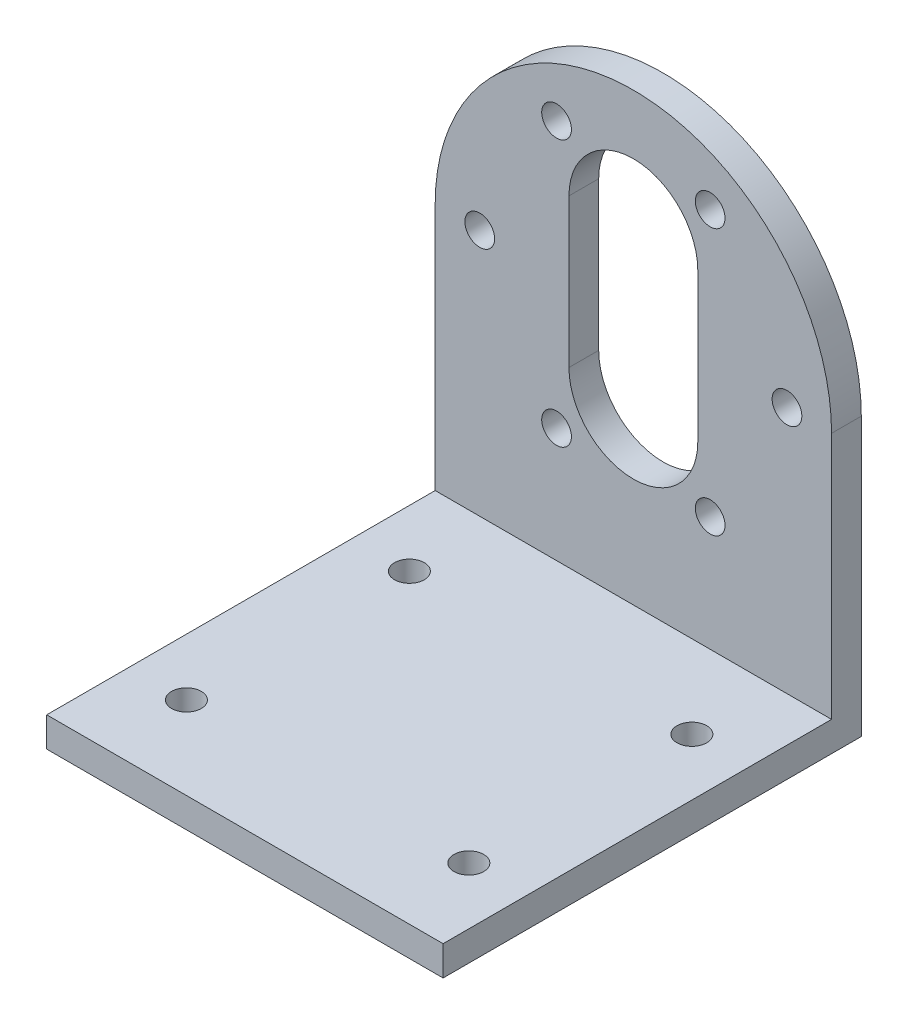
ISO-10303-21;
HEADER;
FILE_DESCRIPTION(('STEP AP214'),'2;1');
FILE_NAME('part.step','',(''),(''),'','','');
FILE_SCHEMA(('AUTOMOTIVE_DESIGN { 1 0 10303 214 1 1 1 1 }'));
ENDSEC;
DATA;
#1=APPLICATION_CONTEXT('core data for automotive mechanical design processes');
#2=APPLICATION_PROTOCOL_DEFINITION('international standard','automotive_design',2000,#1);
#3=PRODUCT_CONTEXT('',#1,'mechanical');
#4=PRODUCT('Part','Part','',(#3));
#5=PRODUCT_RELATED_PRODUCT_CATEGORY('part','',(#4));
#6=PRODUCT_DEFINITION_FORMATION('','',#4);
#7=PRODUCT_DEFINITION_CONTEXT('part definition',#1,'design');
#8=PRODUCT_DEFINITION('design','',#6,#7);
#9=PRODUCT_DEFINITION_SHAPE('','',#8);
#10=(LENGTH_UNIT() NAMED_UNIT(*) SI_UNIT(.MILLI.,.METRE.));
#11=(NAMED_UNIT(*) PLANE_ANGLE_UNIT() SI_UNIT($,.RADIAN.));
#12=(NAMED_UNIT(*) SI_UNIT($,.STERADIAN.) SOLID_ANGLE_UNIT());
#13=UNCERTAINTY_MEASURE_WITH_UNIT(LENGTH_MEASURE(1.E-05),#10,'distance_accuracy_value','');
#14=(GEOMETRIC_REPRESENTATION_CONTEXT(3) GLOBAL_UNCERTAINTY_ASSIGNED_CONTEXT((#13)) GLOBAL_UNIT_ASSIGNED_CONTEXT((#10,
#11,#12)) REPRESENTATION_CONTEXT('',''));
#15=CARTESIAN_POINT('',(0.,0.,0.));
#16=DIRECTION('',(0.,0.,1.));
#17=DIRECTION('',(1.,0.,0.));
#18=AXIS2_PLACEMENT_3D('',#15,#16,#17);
#19=CARTESIAN_POINT('',(0.,0.,3.));
#20=DIRECTION('',(0.,0.,1.));
#21=DIRECTION('',(1.,0.,0.));
#22=AXIS2_PLACEMENT_3D('',#19,#20,#21);
#23=PLANE('',#22);
#24=CARTESIAN_POINT('',(7.74999999999988,-13.4233937586589,3.));
#25=DIRECTION('',(0.,0.,1.));
#26=DIRECTION('',(1.,0.,0.));
#27=AXIS2_PLACEMENT_3D('',#24,#25,#26);
#28=CIRCLE('',#27,1.5);
#29=CARTESIAN_POINT('',(9.24999999999988,-13.4233937586589,3.));
#30=VERTEX_POINT('',#29);
#31=EDGE_CURVE('E147',#30,#30,#28,.T.);
#32=ORIENTED_EDGE('',*,*,#31,.F.);
#33=EDGE_LOOP('',(#32));
#34=FACE_BOUND('',#33,.T.);
#35=CARTESIAN_POINT('',(7.75000000000006,13.4233937586588,3.));
#36=DIRECTION('',(0.,0.,1.));
#37=DIRECTION('',(1.,0.,0.));
#38=AXIS2_PLACEMENT_3D('',#35,#36,#37);
#39=CIRCLE('',#38,1.5);
#40=CARTESIAN_POINT('',(9.25000000000006,13.4233937586588,3.));
#41=VERTEX_POINT('',#40);
#42=EDGE_CURVE('E159',#41,#41,#39,.T.);
#43=ORIENTED_EDGE('',*,*,#42,.F.);
#44=EDGE_LOOP('',(#43));
#45=FACE_BOUND('',#44,.T.);
#46=CARTESIAN_POINT('',(-15.5,0.,3.));
#47=DIRECTION('',(0.,0.,1.));
#48=DIRECTION('',(1.,0.,0.));
#49=AXIS2_PLACEMENT_3D('',#46,#47,#48);
#50=CIRCLE('',#49,1.5);
#51=CARTESIAN_POINT('',(-14.,0.,3.));
#52=VERTEX_POINT('',#51);
#53=EDGE_CURVE('E171',#52,#52,#50,.T.);
#54=ORIENTED_EDGE('',*,*,#53,.F.);
#55=EDGE_LOOP('',(#54));
#56=FACE_BOUND('',#55,.T.);
#57=DIRECTION('',(0.,-1.,0.));
#58=VECTOR('',#57,1.);
#59=CARTESIAN_POINT('',(-6.5,7.5,3.));
#60=LINE('',#59,#58);
#61=CARTESIAN_POINT('',(-6.5,7.5,3.));
#62=VERTEX_POINT('',#61);
#63=CARTESIAN_POINT('',(-6.5,-7.5,3.));
#64=VERTEX_POINT('',#63);
#65=EDGE_CURVE('E179',#62,#64,#60,.T.);
#66=ORIENTED_EDGE('',*,*,#65,.F.);
#67=CARTESIAN_POINT('',(0.,7.5,3.));
#68=DIRECTION('',(0.,0.,1.));
#69=DIRECTION('',(1.,0.,0.));
#70=AXIS2_PLACEMENT_3D('',#67,#68,#69);
#71=CIRCLE('',#70,6.5);
#72=CARTESIAN_POINT('',(6.5,7.5,3.));
#73=VERTEX_POINT('',#72);
#74=EDGE_CURVE('E177',#73,#62,#71,.T.);
#75=ORIENTED_EDGE('',*,*,#74,.F.);
#76=DIRECTION('',(0.,1.,0.));
#77=VECTOR('',#76,1.);
#78=CARTESIAN_POINT('',(6.5,7.5,3.));
#79=LINE('',#78,#77);
#80=CARTESIAN_POINT('',(6.5,-7.5,3.));
#81=VERTEX_POINT('',#80);
#82=EDGE_CURVE('E185',#81,#73,#79,.T.);
#83=ORIENTED_EDGE('',*,*,#82,.F.);
#84=CARTESIAN_POINT('',(0.,-7.5,3.));
#85=DIRECTION('',(0.,0.,1.));
#86=DIRECTION('',(1.,0.,0.));
#87=AXIS2_PLACEMENT_3D('',#84,#85,#86);
#88=CIRCLE('',#87,6.5);
#89=EDGE_CURVE('E182',#64,#81,#88,.T.);
#90=ORIENTED_EDGE('',*,*,#89,.F.);
#91=EDGE_LOOP('',(#66,#75,#83,#90));
#92=FACE_BOUND('',#91,.T.);
#93=CARTESIAN_POINT('',(-7.74999999999997,13.4233937586588,3.));
#94=DIRECTION('',(0.,0.,1.));
#95=DIRECTION('',(1.,0.,0.));
#96=AXIS2_PLACEMENT_3D('',#93,#94,#95);
#97=CIRCLE('',#96,1.5);
#98=CARTESIAN_POINT('',(-6.24999999999997,13.4233937586588,3.));
#99=VERTEX_POINT('',#98);
#100=EDGE_CURVE('E165',#99,#99,#97,.T.);
#101=ORIENTED_EDGE('',*,*,#100,.F.);
#102=EDGE_LOOP('',(#101));
#103=FACE_BOUND('',#102,.T.);
#104=CARTESIAN_POINT('',(15.5,-1.06657560583411E-13,3.));
#105=DIRECTION('',(0.,0.,1.));
#106=DIRECTION('',(1.,0.,0.));
#107=AXIS2_PLACEMENT_3D('',#104,#105,#106);
#108=CIRCLE('',#107,1.5);
#109=CARTESIAN_POINT('',(17.,-1.06657560583411E-13,3.));
#110=VERTEX_POINT('',#109);
#111=EDGE_CURVE('E153',#110,#110,#108,.T.);
#112=ORIENTED_EDGE('',*,*,#111,.F.);
#113=EDGE_LOOP('',(#112));
#114=FACE_BOUND('',#113,.T.);
#115=CARTESIAN_POINT('',(-7.75000000000016,-13.4233937586587,3.));
#116=DIRECTION('',(0.,0.,1.));
#117=DIRECTION('',(1.,0.,0.));
#118=AXIS2_PLACEMENT_3D('',#115,#116,#117);
#119=CIRCLE('',#118,1.5);
#120=CARTESIAN_POINT('',(-6.25000000000015,-13.4233937586587,3.));
#121=VERTEX_POINT('',#120);
#122=EDGE_CURVE('E141',#121,#121,#119,.T.);
#123=ORIENTED_EDGE('',*,*,#122,.F.);
#124=EDGE_LOOP('',(#123));
#125=FACE_BOUND('',#124,.T.);
#126=DIRECTION('',(0.,-1.,0.));
#127=VECTOR('',#126,1.);
#128=CARTESIAN_POINT('',(-20.,0.,3.));
#129=LINE('',#128,#127);
#130=CARTESIAN_POINT('',(-20.,0.,3.));
#131=VERTEX_POINT('',#130);
#132=CARTESIAN_POINT('',(-20.,-25.,3.));
#133=VERTEX_POINT('',#132);
#134=EDGE_CURVE('E47',#131,#133,#129,.T.);
#135=ORIENTED_EDGE('',*,*,#134,.T.);
#136=DIRECTION('',(1.,0.,0.));
#137=VECTOR('',#136,1.);
#138=CARTESIAN_POINT('',(0.,-25.,3.));
#139=LINE('',#138,#137);
#140=CARTESIAN_POINT('',(20.,-25.,3.));
#141=VERTEX_POINT('',#140);
#142=EDGE_CURVE('E51',#133,#141,#139,.T.);
#143=ORIENTED_EDGE('',*,*,#142,.T.);
#144=DIRECTION('',(0.,1.,0.));
#145=VECTOR('',#144,1.);
#146=CARTESIAN_POINT('',(20.,-28.,3.));
#147=LINE('',#146,#145);
#148=CARTESIAN_POINT('',(20.,0.,3.));
#149=VERTEX_POINT('',#148);
#150=EDGE_CURVE('E114',#141,#149,#147,.T.);
#151=ORIENTED_EDGE('',*,*,#150,.T.);
#152=CARTESIAN_POINT('',(0.,0.,3.));
#153=DIRECTION('',(0.,0.,1.));
#154=DIRECTION('',(1.,0.,0.));
#155=AXIS2_PLACEMENT_3D('',#152,#153,#154);
#156=CIRCLE('',#155,20.);
#157=EDGE_CURVE('E208',#149,#131,#156,.T.);
#158=ORIENTED_EDGE('',*,*,#157,.T.);
#159=EDGE_LOOP('',(#135,#143,#151,#158));
#160=FACE_BOUND('',#159,.T.);
#161=ADVANCED_FACE('F32',(#34,#45,#56,#92,#103,#114,#125,#160),#23,.T.);
#162=CARTESIAN_POINT('',(0.,0.,0.));
#163=DIRECTION('',(0.,0.,1.));
#164=DIRECTION('',(1.,0.,0.));
#165=AXIS2_PLACEMENT_3D('',#162,#163,#164);
#166=PLANE('',#165);
#167=DIRECTION('',(1.,0.,0.));
#168=VECTOR('',#167,1.);
#169=CARTESIAN_POINT('',(-20.,-28.,0.));
#170=LINE('',#169,#168);
#171=CARTESIAN_POINT('',(-20.,-28.,0.));
#172=VERTEX_POINT('',#171);
#173=CARTESIAN_POINT('',(20.,-28.,0.));
#174=VERTEX_POINT('',#173);
#175=EDGE_CURVE('E218',#172,#174,#170,.T.);
#176=ORIENTED_EDGE('',*,*,#175,.F.);
#177=DIRECTION('',(0.,-1.,0.));
#178=VECTOR('',#177,1.);
#179=CARTESIAN_POINT('',(-20.,0.,0.));
#180=LINE('',#179,#178);
#181=CARTESIAN_POINT('',(-20.,0.,0.));
#182=VERTEX_POINT('',#181);
#183=EDGE_CURVE('E216',#182,#172,#180,.T.);
#184=ORIENTED_EDGE('',*,*,#183,.F.);
#185=CARTESIAN_POINT('',(0.,0.,0.));
#186=DIRECTION('',(0.,0.,1.));
#187=DIRECTION('',(1.,0.,0.));
#188=AXIS2_PLACEMENT_3D('',#185,#186,#187);
#189=CIRCLE('',#188,20.);
#190=CARTESIAN_POINT('',(20.,0.,0.));
#191=VERTEX_POINT('',#190);
#192=EDGE_CURVE('E207',#191,#182,#189,.T.);
#193=ORIENTED_EDGE('',*,*,#192,.F.);
#194=DIRECTION('',(0.,1.,0.));
#195=VECTOR('',#194,1.);
#196=CARTESIAN_POINT('',(20.,-28.,0.));
#197=LINE('',#196,#195);
#198=EDGE_CURVE('E210',#174,#191,#197,.T.);
#199=ORIENTED_EDGE('',*,*,#198,.F.);
#200=EDGE_LOOP('',(#176,#184,#193,#199));
#201=FACE_BOUND('',#200,.T.);
#202=CARTESIAN_POINT('',(-7.75000000000016,-13.4233937586587,0.));
#203=DIRECTION('',(0.,0.,1.));
#204=DIRECTION('',(1.,0.,0.));
#205=AXIS2_PLACEMENT_3D('',#202,#203,#204);
#206=CIRCLE('',#205,1.5);
#207=CARTESIAN_POINT('',(-6.25000000000015,-13.4233937586587,0.));
#208=VERTEX_POINT('',#207);
#209=EDGE_CURVE('E140',#208,#208,#206,.T.);
#210=ORIENTED_EDGE('',*,*,#209,.T.);
#211=EDGE_LOOP('',(#210));
#212=FACE_BOUND('',#211,.T.);
#213=CARTESIAN_POINT('',(7.74999999999988,-13.4233937586589,0.));
#214=DIRECTION('',(0.,0.,1.));
#215=DIRECTION('',(1.,0.,0.));
#216=AXIS2_PLACEMENT_3D('',#213,#214,#215);
#217=CIRCLE('',#216,1.5);
#218=CARTESIAN_POINT('',(9.24999999999988,-13.4233937586589,0.));
#219=VERTEX_POINT('',#218);
#220=EDGE_CURVE('E144',#219,#219,#217,.T.);
#221=ORIENTED_EDGE('',*,*,#220,.T.);
#222=EDGE_LOOP('',(#221));
#223=FACE_BOUND('',#222,.T.);
#224=CARTESIAN_POINT('',(15.5,-1.06657560583411E-13,0.));
#225=DIRECTION('',(0.,0.,1.));
#226=DIRECTION('',(1.,0.,0.));
#227=AXIS2_PLACEMENT_3D('',#224,#225,#226);
#228=CIRCLE('',#227,1.5);
#229=CARTESIAN_POINT('',(17.,-1.06657560583411E-13,0.));
#230=VERTEX_POINT('',#229);
#231=EDGE_CURVE('E150',#230,#230,#228,.T.);
#232=ORIENTED_EDGE('',*,*,#231,.T.);
#233=EDGE_LOOP('',(#232));
#234=FACE_BOUND('',#233,.T.);
#235=CARTESIAN_POINT('',(7.75000000000006,13.4233937586588,0.));
#236=DIRECTION('',(0.,0.,1.));
#237=DIRECTION('',(1.,0.,0.));
#238=AXIS2_PLACEMENT_3D('',#235,#236,#237);
#239=CIRCLE('',#238,1.5);
#240=CARTESIAN_POINT('',(9.25000000000006,13.4233937586588,0.));
#241=VERTEX_POINT('',#240);
#242=EDGE_CURVE('E156',#241,#241,#239,.T.);
#243=ORIENTED_EDGE('',*,*,#242,.T.);
#244=EDGE_LOOP('',(#243));
#245=FACE_BOUND('',#244,.T.);
#246=CARTESIAN_POINT('',(-7.74999999999997,13.4233937586588,0.));
#247=DIRECTION('',(0.,0.,1.));
#248=DIRECTION('',(1.,0.,0.));
#249=AXIS2_PLACEMENT_3D('',#246,#247,#248);
#250=CIRCLE('',#249,1.5);
#251=CARTESIAN_POINT('',(-6.24999999999997,13.4233937586588,0.));
#252=VERTEX_POINT('',#251);
#253=EDGE_CURVE('E162',#252,#252,#250,.T.);
#254=ORIENTED_EDGE('',*,*,#253,.T.);
#255=EDGE_LOOP('',(#254));
#256=FACE_BOUND('',#255,.T.);
#257=CARTESIAN_POINT('',(-15.5,0.,0.));
#258=DIRECTION('',(0.,0.,1.));
#259=DIRECTION('',(1.,0.,0.));
#260=AXIS2_PLACEMENT_3D('',#257,#258,#259);
#261=CIRCLE('',#260,1.5);
#262=CARTESIAN_POINT('',(-14.,0.,0.));
#263=VERTEX_POINT('',#262);
#264=EDGE_CURVE('E168',#263,#263,#261,.T.);
#265=ORIENTED_EDGE('',*,*,#264,.T.);
#266=EDGE_LOOP('',(#265));
#267=FACE_BOUND('',#266,.T.);
#268=CARTESIAN_POINT('',(0.,7.5,0.));
#269=DIRECTION('',(0.,0.,1.));
#270=DIRECTION('',(1.,0.,0.));
#271=AXIS2_PLACEMENT_3D('',#268,#269,#270);
#272=CIRCLE('',#271,6.5);
#273=CARTESIAN_POINT('',(6.5,7.5,0.));
#274=VERTEX_POINT('',#273);
#275=CARTESIAN_POINT('',(-6.5,7.5,0.));
#276=VERTEX_POINT('',#275);
#277=EDGE_CURVE('E174',#274,#276,#272,.T.);
#278=ORIENTED_EDGE('',*,*,#277,.T.);
#279=DIRECTION('',(0.,-1.,0.));
#280=VECTOR('',#279,1.);
#281=CARTESIAN_POINT('',(-6.5,7.5,0.));
#282=LINE('',#281,#280);
#283=CARTESIAN_POINT('',(-6.5,-7.5,0.));
#284=VERTEX_POINT('',#283);
#285=EDGE_CURVE('E190',#276,#284,#282,.T.);
#286=ORIENTED_EDGE('',*,*,#285,.T.);
#287=CARTESIAN_POINT('',(0.,-7.5,0.));
#288=DIRECTION('',(0.,0.,1.));
#289=DIRECTION('',(1.,0.,0.));
#290=AXIS2_PLACEMENT_3D('',#287,#288,#289);
#291=CIRCLE('',#290,6.5);
#292=CARTESIAN_POINT('',(6.5,-7.5,0.));
#293=VERTEX_POINT('',#292);
#294=EDGE_CURVE('E193',#284,#293,#291,.T.);
#295=ORIENTED_EDGE('',*,*,#294,.T.);
#296=DIRECTION('',(0.,1.,0.));
#297=VECTOR('',#296,1.);
#298=CARTESIAN_POINT('',(6.5,7.5,0.));
#299=LINE('',#298,#297);
#300=EDGE_CURVE('E180',#293,#274,#299,.T.);
#301=ORIENTED_EDGE('',*,*,#300,.T.);
#302=EDGE_LOOP('',(#278,#286,#295,#301));
#303=FACE_BOUND('',#302,.T.);
#304=ADVANCED_FACE('F232',(#201,#212,#223,#234,#245,#256,#267,#303),#166,.F.);
#305=CARTESIAN_POINT('',(0.,0.,3.));
#306=DIRECTION('',(0.,0.,-1.));
#307=DIRECTION('',(-1.,0.,0.));
#308=AXIS2_PLACEMENT_3D('',#305,#306,#307);
#309=CYLINDRICAL_SURFACE('',#308,20.);
#310=ORIENTED_EDGE('',*,*,#192,.T.);
#311=DIRECTION('',(0.,0.,-1.));
#312=VECTOR('',#311,1.);
#313=CARTESIAN_POINT('',(-20.,0.,3.));
#314=LINE('',#313,#312);
#315=EDGE_CURVE('E11',#131,#182,#314,.T.);
#316=ORIENTED_EDGE('',*,*,#315,.F.);
#317=ORIENTED_EDGE('',*,*,#157,.F.);
#318=DIRECTION('',(0.,0.,-1.));
#319=VECTOR('',#318,1.);
#320=CARTESIAN_POINT('',(20.,0.,3.));
#321=LINE('',#320,#319);
#322=EDGE_CURVE('E213',#149,#191,#321,.T.);
#323=ORIENTED_EDGE('',*,*,#322,.T.);
#324=EDGE_LOOP('',(#310,#316,#317,#323));
#325=FACE_BOUND('',#324,.T.);
#326=ADVANCED_FACE('F34',(#325),#309,.T.);
#327=CARTESIAN_POINT('',(-20.,0.,3.));
#328=DIRECTION('',(1.,0.,0.));
#329=DIRECTION('',(0.,1.,0.));
#330=AXIS2_PLACEMENT_3D('',#327,#328,#329);
#331=PLANE('',#330);
#332=DIRECTION('',(0.,0.,-1.));
#333=VECTOR('',#332,1.);
#334=CARTESIAN_POINT('',(-20.,-28.,3.));
#335=LINE('',#334,#333);
#336=CARTESIAN_POINT('',(-20.,-28.,42.2));
#337=VERTEX_POINT('',#336);
#338=EDGE_CURVE('E40',#337,#172,#335,.T.);
#339=ORIENTED_EDGE('',*,*,#338,.F.);
#340=DIRECTION('',(0.,-1.,0.));
#341=VECTOR('',#340,1.);
#342=CARTESIAN_POINT('',(-20.,-25.,42.2));
#343=LINE('',#342,#341);
#344=CARTESIAN_POINT('',(-20.,-25.,42.2));
#345=VERTEX_POINT('',#344);
#346=EDGE_CURVE('E125',#345,#337,#343,.T.);
#347=ORIENTED_EDGE('',*,*,#346,.F.);
#348=DIRECTION('',(0.,0.,-1.));
#349=VECTOR('',#348,1.);
#350=CARTESIAN_POINT('',(-20.,-25.,0.));
#351=LINE('',#350,#349);
#352=EDGE_CURVE('E126',#345,#133,#351,.T.);
#353=ORIENTED_EDGE('',*,*,#352,.T.);
#354=ORIENTED_EDGE('',*,*,#134,.F.);
#355=ORIENTED_EDGE('',*,*,#315,.T.);
#356=ORIENTED_EDGE('',*,*,#183,.T.);
#357=EDGE_LOOP('',(#339,#347,#353,#354,#355,#356));
#358=FACE_BOUND('',#357,.T.);
#359=ADVANCED_FACE('F254',(#358),#331,.F.);
#360=CARTESIAN_POINT('',(-20.,-28.,3.));
#361=DIRECTION('',(0.,1.,0.));
#362=DIRECTION('',(-1.,0.,0.));
#363=AXIS2_PLACEMENT_3D('',#360,#361,#362);
#364=PLANE('',#363);
#365=ORIENTED_EDGE('',*,*,#175,.T.);
#366=DIRECTION('',(0.,0.,-1.));
#367=VECTOR('',#366,1.);
#368=CARTESIAN_POINT('',(20.,-28.,3.));
#369=LINE('',#368,#367);
#370=CARTESIAN_POINT('',(20.,-28.,42.2));
#371=VERTEX_POINT('',#370);
#372=EDGE_CURVE('E223',#371,#174,#369,.T.);
#373=ORIENTED_EDGE('',*,*,#372,.F.);
#374=DIRECTION('',(-1.,0.,0.));
#375=VECTOR('',#374,1.);
#376=CARTESIAN_POINT('',(20.,-28.,42.2));
#377=LINE('',#376,#375);
#378=EDGE_CURVE('E118',#371,#337,#377,.T.);
#379=ORIENTED_EDGE('',*,*,#378,.T.);
#380=ORIENTED_EDGE('',*,*,#338,.T.);
#381=EDGE_LOOP('',(#365,#373,#379,#380));
#382=FACE_BOUND('',#381,.T.);
#383=CARTESIAN_POINT('',(-14.2500000000001,-28.,33.85));
#384=DIRECTION('',(0.,-1.,0.));
#385=DIRECTION('',(1.,0.,0.));
#386=AXIS2_PLACEMENT_3D('',#383,#384,#385);
#387=CIRCLE('',#386,1.5);
#388=CARTESIAN_POINT('',(-12.7500000000001,-28.,33.85));
#389=VERTEX_POINT('',#388);
#390=EDGE_CURVE('E496',#389,#389,#387,.T.);
#391=ORIENTED_EDGE('',*,*,#390,.F.);
#392=EDGE_LOOP('',(#391));
#393=FACE_BOUND('',#392,.T.);
#394=CARTESIAN_POINT('',(14.2499999999999,-28.,33.85));
#395=DIRECTION('',(0.,-1.,0.));
#396=DIRECTION('',(1.,0.,0.));
#397=AXIS2_PLACEMENT_3D('',#394,#395,#396);
#398=CIRCLE('',#397,1.5);
#399=CARTESIAN_POINT('',(15.7499999999999,-28.,33.85));
#400=VERTEX_POINT('',#399);
#401=EDGE_CURVE('E498',#400,#400,#398,.T.);
#402=ORIENTED_EDGE('',*,*,#401,.F.);
#403=EDGE_LOOP('',(#402));
#404=FACE_BOUND('',#403,.T.);
#405=CARTESIAN_POINT('',(14.25,-28.,11.35));
#406=DIRECTION('',(0.,-1.,0.));
#407=DIRECTION('',(1.,0.,0.));
#408=AXIS2_PLACEMENT_3D('',#405,#406,#407);
#409=CIRCLE('',#408,1.5);
#410=CARTESIAN_POINT('',(15.75,-28.,11.35));
#411=VERTEX_POINT('',#410);
#412=EDGE_CURVE('E504',#411,#411,#409,.T.);
#413=ORIENTED_EDGE('',*,*,#412,.F.);
#414=EDGE_LOOP('',(#413));
#415=FACE_BOUND('',#414,.T.);
#416=CARTESIAN_POINT('',(-14.25,-28.,11.35));
#417=DIRECTION('',(0.,-1.,0.));
#418=DIRECTION('',(1.,0.,0.));
#419=AXIS2_PLACEMENT_3D('',#416,#417,#418);
#420=CIRCLE('',#419,1.5);
#421=CARTESIAN_POINT('',(-12.75,-28.,11.35));
#422=VERTEX_POINT('',#421);
#423=EDGE_CURVE('E510',#422,#422,#420,.T.);
#424=ORIENTED_EDGE('',*,*,#423,.F.);
#425=EDGE_LOOP('',(#424));
#426=FACE_BOUND('',#425,.T.);
#427=ADVANCED_FACE('F227',(#382,#393,#404,#415,#426),#364,.F.);
#428=CARTESIAN_POINT('',(20.,-28.,3.));
#429=DIRECTION('',(-1.,0.,0.));
#430=DIRECTION('',(0.,-1.,0.));
#431=AXIS2_PLACEMENT_3D('',#428,#429,#430);
#432=PLANE('',#431);
#433=ORIENTED_EDGE('',*,*,#198,.T.);
#434=ORIENTED_EDGE('',*,*,#322,.F.);
#435=ORIENTED_EDGE('',*,*,#150,.F.);
#436=DIRECTION('',(0.,0.,1.));
#437=VECTOR('',#436,1.);
#438=CARTESIAN_POINT('',(20.,-25.,0.));
#439=LINE('',#438,#437);
#440=CARTESIAN_POINT('',(20.,-25.,42.2));
#441=VERTEX_POINT('',#440);
#442=EDGE_CURVE('E107',#141,#441,#439,.T.);
#443=ORIENTED_EDGE('',*,*,#442,.T.);
#444=DIRECTION('',(0.,-1.,0.));
#445=VECTOR('',#444,1.);
#446=CARTESIAN_POINT('',(20.,-25.,42.2));
#447=LINE('',#446,#445);
#448=EDGE_CURVE('E111',#441,#371,#447,.T.);
#449=ORIENTED_EDGE('',*,*,#448,.T.);
#450=ORIENTED_EDGE('',*,*,#372,.T.);
#451=EDGE_LOOP('',(#433,#434,#435,#443,#449,#450));
#452=FACE_BOUND('',#451,.T.);
#453=ADVANCED_FACE('F109',(#452),#432,.F.);
#454=CARTESIAN_POINT('',(0.,7.5,3.));
#455=DIRECTION('',(0.,0.,-1.));
#456=DIRECTION('',(-1.,0.,0.));
#457=AXIS2_PLACEMENT_3D('',#454,#455,#456);
#458=CYLINDRICAL_SURFACE('',#457,6.5);
#459=ORIENTED_EDGE('',*,*,#277,.F.);
#460=DIRECTION('',(0.,0.,-1.));
#461=VECTOR('',#460,1.);
#462=CARTESIAN_POINT('',(6.5,7.5,3.));
#463=LINE('',#462,#461);
#464=EDGE_CURVE('E187',#73,#274,#463,.T.);
#465=ORIENTED_EDGE('',*,*,#464,.F.);
#466=ORIENTED_EDGE('',*,*,#74,.T.);
#467=DIRECTION('',(0.,0.,-1.));
#468=VECTOR('',#467,1.);
#469=CARTESIAN_POINT('',(-6.5,7.5,3.));
#470=LINE('',#469,#468);
#471=EDGE_CURVE('E204',#62,#276,#470,.T.);
#472=ORIENTED_EDGE('',*,*,#471,.T.);
#473=EDGE_LOOP('',(#459,#465,#466,#472));
#474=FACE_BOUND('',#473,.T.);
#475=ADVANCED_FACE('F248',(#474),#458,.F.);
#476=CARTESIAN_POINT('',(-6.5,7.5,3.));
#477=DIRECTION('',(1.,0.,0.));
#478=DIRECTION('',(0.,0.,-1.));
#479=AXIS2_PLACEMENT_3D('',#476,#477,#478);
#480=PLANE('',#479);
#481=ORIENTED_EDGE('',*,*,#285,.F.);
#482=ORIENTED_EDGE('',*,*,#471,.F.);
#483=ORIENTED_EDGE('',*,*,#65,.T.);
#484=DIRECTION('',(0.,0.,-1.));
#485=VECTOR('',#484,1.);
#486=CARTESIAN_POINT('',(-6.5,-7.5,3.));
#487=LINE('',#486,#485);
#488=EDGE_CURVE('E202',#64,#284,#487,.T.);
#489=ORIENTED_EDGE('',*,*,#488,.T.);
#490=EDGE_LOOP('',(#481,#482,#483,#489));
#491=FACE_BOUND('',#490,.T.);
#492=ADVANCED_FACE('F382',(#491),#480,.T.);
#493=CARTESIAN_POINT('',(0.,-7.5,3.));
#494=DIRECTION('',(0.,0.,-1.));
#495=DIRECTION('',(-1.,0.,0.));
#496=AXIS2_PLACEMENT_3D('',#493,#494,#495);
#497=CYLINDRICAL_SURFACE('',#496,6.5);
#498=ORIENTED_EDGE('',*,*,#294,.F.);
#499=ORIENTED_EDGE('',*,*,#488,.F.);
#500=ORIENTED_EDGE('',*,*,#89,.T.);
#501=DIRECTION('',(0.,0.,-1.));
#502=VECTOR('',#501,1.);
#503=CARTESIAN_POINT('',(6.5,-7.5,3.));
#504=LINE('',#503,#502);
#505=EDGE_CURVE('E200',#81,#293,#504,.T.);
#506=ORIENTED_EDGE('',*,*,#505,.T.);
#507=EDGE_LOOP('',(#498,#499,#500,#506));
#508=FACE_BOUND('',#507,.T.);
#509=ADVANCED_FACE('F379',(#508),#497,.F.);
#510=CARTESIAN_POINT('',(6.5,7.5,3.));
#511=DIRECTION('',(-1.,0.,0.));
#512=DIRECTION('',(0.,0.,1.));
#513=AXIS2_PLACEMENT_3D('',#510,#511,#512);
#514=PLANE('',#513);
#515=ORIENTED_EDGE('',*,*,#300,.F.);
#516=ORIENTED_EDGE('',*,*,#505,.F.);
#517=ORIENTED_EDGE('',*,*,#82,.T.);
#518=ORIENTED_EDGE('',*,*,#464,.T.);
#519=EDGE_LOOP('',(#515,#516,#517,#518));
#520=FACE_BOUND('',#519,.T.);
#521=ADVANCED_FACE('F375',(#520),#514,.T.);
#522=CARTESIAN_POINT('',(-15.5,0.,3.));
#523=DIRECTION('',(0.,0.,-1.));
#524=DIRECTION('',(-1.,0.,0.));
#525=AXIS2_PLACEMENT_3D('',#522,#523,#524);
#526=CYLINDRICAL_SURFACE('',#525,1.5);
#527=ORIENTED_EDGE('',*,*,#53,.T.);
#528=EDGE_LOOP('',(#527));
#529=FACE_BOUND('',#528,.T.);
#530=ORIENTED_EDGE('',*,*,#264,.F.);
#531=EDGE_LOOP('',(#530));
#532=FACE_BOUND('',#531,.T.);
#533=ADVANCED_FACE('F371',(#529,#532),#526,.F.);
#534=CARTESIAN_POINT('',(-7.74999999999997,13.4233937586588,3.));
#535=DIRECTION('',(0.,0.,-1.));
#536=DIRECTION('',(-1.,0.,0.));
#537=AXIS2_PLACEMENT_3D('',#534,#535,#536);
#538=CYLINDRICAL_SURFACE('',#537,1.5);
#539=ORIENTED_EDGE('',*,*,#100,.T.);
#540=EDGE_LOOP('',(#539));
#541=FACE_BOUND('',#540,.T.);
#542=ORIENTED_EDGE('',*,*,#253,.F.);
#543=EDGE_LOOP('',(#542));
#544=FACE_BOUND('',#543,.T.);
#545=ADVANCED_FACE('F367',(#541,#544),#538,.F.);
#546=CARTESIAN_POINT('',(7.75000000000006,13.4233937586588,3.));
#547=DIRECTION('',(0.,0.,-1.));
#548=DIRECTION('',(-1.,0.,0.));
#549=AXIS2_PLACEMENT_3D('',#546,#547,#548);
#550=CYLINDRICAL_SURFACE('',#549,1.5);
#551=ORIENTED_EDGE('',*,*,#42,.T.);
#552=EDGE_LOOP('',(#551));
#553=FACE_BOUND('',#552,.T.);
#554=ORIENTED_EDGE('',*,*,#242,.F.);
#555=EDGE_LOOP('',(#554));
#556=FACE_BOUND('',#555,.T.);
#557=ADVANCED_FACE('F363',(#553,#556),#550,.F.);
#558=CARTESIAN_POINT('',(15.5,-1.06657560583411E-13,3.));
#559=DIRECTION('',(0.,0.,-1.));
#560=DIRECTION('',(-1.,0.,0.));
#561=AXIS2_PLACEMENT_3D('',#558,#559,#560);
#562=CYLINDRICAL_SURFACE('',#561,1.5);
#563=ORIENTED_EDGE('',*,*,#111,.T.);
#564=EDGE_LOOP('',(#563));
#565=FACE_BOUND('',#564,.T.);
#566=ORIENTED_EDGE('',*,*,#231,.F.);
#567=EDGE_LOOP('',(#566));
#568=FACE_BOUND('',#567,.T.);
#569=ADVANCED_FACE('F359',(#565,#568),#562,.F.);
#570=CARTESIAN_POINT('',(7.74999999999988,-13.4233937586589,3.));
#571=DIRECTION('',(0.,0.,-1.));
#572=DIRECTION('',(-1.,0.,0.));
#573=AXIS2_PLACEMENT_3D('',#570,#571,#572);
#574=CYLINDRICAL_SURFACE('',#573,1.5);
#575=ORIENTED_EDGE('',*,*,#31,.T.);
#576=EDGE_LOOP('',(#575));
#577=FACE_BOUND('',#576,.T.);
#578=ORIENTED_EDGE('',*,*,#220,.F.);
#579=EDGE_LOOP('',(#578));
#580=FACE_BOUND('',#579,.T.);
#581=ADVANCED_FACE('F355',(#577,#580),#574,.F.);
#582=CARTESIAN_POINT('',(-7.75000000000016,-13.4233937586587,3.));
#583=DIRECTION('',(0.,0.,-1.));
#584=DIRECTION('',(-1.,0.,0.));
#585=AXIS2_PLACEMENT_3D('',#582,#583,#584);
#586=CYLINDRICAL_SURFACE('',#585,1.5);
#587=ORIENTED_EDGE('',*,*,#122,.T.);
#588=EDGE_LOOP('',(#587));
#589=FACE_BOUND('',#588,.T.);
#590=ORIENTED_EDGE('',*,*,#209,.F.);
#591=EDGE_LOOP('',(#590));
#592=FACE_BOUND('',#591,.T.);
#593=ADVANCED_FACE('F298',(#589,#592),#586,.F.);
#594=CARTESIAN_POINT('',(20.,-25.,42.2));
#595=DIRECTION('',(0.,0.,1.));
#596=DIRECTION('',(1.,0.,0.));
#597=AXIS2_PLACEMENT_3D('',#594,#595,#596);
#598=PLANE('',#597);
#599=ORIENTED_EDGE('',*,*,#378,.F.);
#600=ORIENTED_EDGE('',*,*,#448,.F.);
#601=DIRECTION('',(-1.,0.,0.));
#602=VECTOR('',#601,1.);
#603=CARTESIAN_POINT('',(20.,-25.,42.2));
#604=LINE('',#603,#602);
#605=EDGE_CURVE('E117',#441,#345,#604,.T.);
#606=ORIENTED_EDGE('',*,*,#605,.T.);
#607=ORIENTED_EDGE('',*,*,#346,.T.);
#608=EDGE_LOOP('',(#599,#600,#606,#607));
#609=FACE_BOUND('',#608,.T.);
#610=ADVANCED_FACE('F122',(#609),#598,.T.);
#611=CARTESIAN_POINT('',(0.,-25.,0.));
#612=DIRECTION('',(0.,-1.,0.));
#613=DIRECTION('',(0.,0.,-1.));
#614=AXIS2_PLACEMENT_3D('',#611,#612,#613);
#615=PLANE('',#614);
#616=ORIENTED_EDGE('',*,*,#142,.F.);
#617=ORIENTED_EDGE('',*,*,#352,.F.);
#618=ORIENTED_EDGE('',*,*,#605,.F.);
#619=ORIENTED_EDGE('',*,*,#442,.F.);
#620=EDGE_LOOP('',(#616,#617,#618,#619));
#621=FACE_BOUND('',#620,.T.);
#622=CARTESIAN_POINT('',(-14.2500000000001,-25.,33.85));
#623=DIRECTION('',(0.,-1.,0.));
#624=DIRECTION('',(1.,0.,0.));
#625=AXIS2_PLACEMENT_3D('',#622,#623,#624);
#626=CIRCLE('',#625,1.5);
#627=CARTESIAN_POINT('',(-12.7500000000001,-25.,33.85));
#628=VERTEX_POINT('',#627);
#629=EDGE_CURVE('E493',#628,#628,#626,.T.);
#630=ORIENTED_EDGE('',*,*,#629,.T.);
#631=EDGE_LOOP('',(#630));
#632=FACE_BOUND('',#631,.T.);
#633=CARTESIAN_POINT('',(14.2499999999999,-25.,33.85));
#634=DIRECTION('',(0.,-1.,0.));
#635=DIRECTION('',(1.,0.,0.));
#636=AXIS2_PLACEMENT_3D('',#633,#634,#635);
#637=CIRCLE('',#636,1.5);
#638=CARTESIAN_POINT('',(15.7499999999999,-25.,33.85));
#639=VERTEX_POINT('',#638);
#640=EDGE_CURVE('E501',#639,#639,#637,.T.);
#641=ORIENTED_EDGE('',*,*,#640,.T.);
#642=EDGE_LOOP('',(#641));
#643=FACE_BOUND('',#642,.T.);
#644=CARTESIAN_POINT('',(14.25,-25.,11.35));
#645=DIRECTION('',(0.,-1.,0.));
#646=DIRECTION('',(1.,0.,0.));
#647=AXIS2_PLACEMENT_3D('',#644,#645,#646);
#648=CIRCLE('',#647,1.5);
#649=CARTESIAN_POINT('',(15.75,-25.,11.35));
#650=VERTEX_POINT('',#649);
#651=EDGE_CURVE('E507',#650,#650,#648,.T.);
#652=ORIENTED_EDGE('',*,*,#651,.T.);
#653=EDGE_LOOP('',(#652));
#654=FACE_BOUND('',#653,.T.);
#655=CARTESIAN_POINT('',(-14.25,-25.,11.35));
#656=DIRECTION('',(0.,-1.,0.));
#657=DIRECTION('',(1.,0.,0.));
#658=AXIS2_PLACEMENT_3D('',#655,#656,#657);
#659=CIRCLE('',#658,1.5);
#660=CARTESIAN_POINT('',(-12.75,-25.,11.35));
#661=VERTEX_POINT('',#660);
#662=EDGE_CURVE('E137',#661,#661,#659,.T.);
#663=ORIENTED_EDGE('',*,*,#662,.T.);
#664=EDGE_LOOP('',(#663));
#665=FACE_BOUND('',#664,.T.);
#666=ADVANCED_FACE('F129',(#621,#632,#643,#654,#665),#615,.F.);
#667=CARTESIAN_POINT('',(-14.25,-25.,11.35));
#668=DIRECTION('',(0.,-1.,0.));
#669=DIRECTION('',(1.,0.,0.));
#670=AXIS2_PLACEMENT_3D('',#667,#668,#669);
#671=CYLINDRICAL_SURFACE('',#670,1.5);
#672=ORIENTED_EDGE('',*,*,#662,.F.);
#673=EDGE_LOOP('',(#672));
#674=FACE_BOUND('',#673,.T.);
#675=ORIENTED_EDGE('',*,*,#423,.T.);
#676=EDGE_LOOP('',(#675));
#677=FACE_BOUND('',#676,.T.);
#678=ADVANCED_FACE('F308',(#674,#677),#671,.F.);
#679=CARTESIAN_POINT('',(14.25,-25.,11.35));
#680=DIRECTION('',(0.,-1.,0.));
#681=DIRECTION('',(1.,0.,0.));
#682=AXIS2_PLACEMENT_3D('',#679,#680,#681);
#683=CYLINDRICAL_SURFACE('',#682,1.5);
#684=ORIENTED_EDGE('',*,*,#651,.F.);
#685=EDGE_LOOP('',(#684));
#686=FACE_BOUND('',#685,.T.);
#687=ORIENTED_EDGE('',*,*,#412,.T.);
#688=EDGE_LOOP('',(#687));
#689=FACE_BOUND('',#688,.T.);
#690=ADVANCED_FACE('F317',(#686,#689),#683,.F.);
#691=CARTESIAN_POINT('',(14.2499999999999,-25.,33.85));
#692=DIRECTION('',(0.,-1.,0.));
#693=DIRECTION('',(1.,0.,0.));
#694=AXIS2_PLACEMENT_3D('',#691,#692,#693);
#695=CYLINDRICAL_SURFACE('',#694,1.5);
#696=ORIENTED_EDGE('',*,*,#640,.F.);
#697=EDGE_LOOP('',(#696));
#698=FACE_BOUND('',#697,.T.);
#699=ORIENTED_EDGE('',*,*,#401,.T.);
#700=EDGE_LOOP('',(#699));
#701=FACE_BOUND('',#700,.T.);
#702=ADVANCED_FACE('F327',(#698,#701),#695,.F.);
#703=CARTESIAN_POINT('',(-14.2500000000001,-25.,33.85));
#704=DIRECTION('',(0.,-1.,0.));
#705=DIRECTION('',(1.,0.,0.));
#706=AXIS2_PLACEMENT_3D('',#703,#704,#705);
#707=CYLINDRICAL_SURFACE('',#706,1.5);
#708=ORIENTED_EDGE('',*,*,#629,.F.);
#709=EDGE_LOOP('',(#708));
#710=FACE_BOUND('',#709,.T.);
#711=ORIENTED_EDGE('',*,*,#390,.T.);
#712=EDGE_LOOP('',(#711));
#713=FACE_BOUND('',#712,.T.);
#714=ADVANCED_FACE('F337',(#710,#713),#707,.F.);
#715=CLOSED_SHELL('',(#161,#304,#326,#359,#427,#453,#475,#492,#509,#521,#533,#545,#557,#569,
#581,#593,#610,#666,#678,#690,#702,#714));
#716=MANIFOLD_SOLID_BREP('B2',#715);
#717=ADVANCED_BREP_SHAPE_REPRESENTATION('',(#18,#716),#14);
#718=SHAPE_DEFINITION_REPRESENTATION(#9,#717);
ENDSEC;
END-ISO-10303-21;
